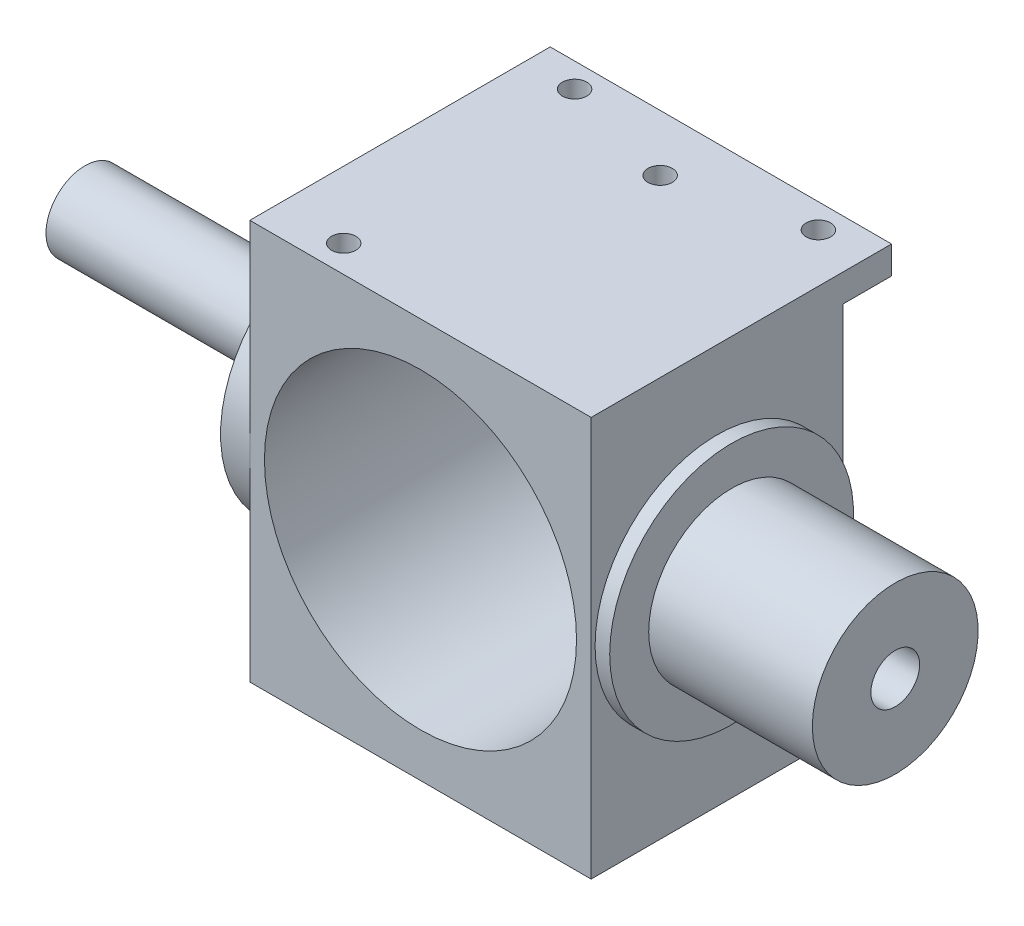
ISO-10303-21;
HEADER;
FILE_DESCRIPTION(('STEP AP214'),'2;1');
FILE_NAME('part.step','',(''),(''),'','','');
FILE_SCHEMA(('AUTOMOTIVE_DESIGN { 1 0 10303 214 1 1 1 1 }'));
ENDSEC;
DATA;
#1=APPLICATION_CONTEXT('core data for automotive mechanical design processes');
#2=APPLICATION_PROTOCOL_DEFINITION('international standard','automotive_design',2000,#1);
#3=PRODUCT_CONTEXT('',#1,'mechanical');
#4=PRODUCT('Part','Part','',(#3));
#5=PRODUCT_RELATED_PRODUCT_CATEGORY('part','',(#4));
#6=PRODUCT_DEFINITION_FORMATION('','',#4);
#7=PRODUCT_DEFINITION_CONTEXT('part definition',#1,'design');
#8=PRODUCT_DEFINITION('design','',#6,#7);
#9=PRODUCT_DEFINITION_SHAPE('','',#8);
#10=(LENGTH_UNIT() NAMED_UNIT(*) SI_UNIT(.MILLI.,.METRE.));
#11=(NAMED_UNIT(*) PLANE_ANGLE_UNIT() SI_UNIT($,.RADIAN.));
#12=(NAMED_UNIT(*) SI_UNIT($,.STERADIAN.) SOLID_ANGLE_UNIT());
#13=UNCERTAINTY_MEASURE_WITH_UNIT(LENGTH_MEASURE(1.E-05),#10,'distance_accuracy_value','');
#14=(GEOMETRIC_REPRESENTATION_CONTEXT(3) GLOBAL_UNCERTAINTY_ASSIGNED_CONTEXT((#13)) GLOBAL_UNIT_ASSIGNED_CONTEXT((#10,
#11,#12)) REPRESENTATION_CONTEXT('',''));
#15=CARTESIAN_POINT('',(0.,0.,0.));
#16=DIRECTION('',(0.,0.,1.));
#17=DIRECTION('',(1.,0.,0.));
#18=AXIS2_PLACEMENT_3D('',#15,#16,#17);
#19=CARTESIAN_POINT('',(53.5807438589496,27.618402196632,37.7129267767126));
#20=DIRECTION('',(-1.,0.,0.));
#21=DIRECTION('',(0.,0.,1.));
#22=AXIS2_PLACEMENT_3D('',#19,#20,#21);
#23=CYLINDRICAL_SURFACE('',#22,8.5);
#24=CARTESIAN_POINT('',(53.5807438589496,27.618402196632,37.7129267767126));
#25=DIRECTION('',(-1.,0.,0.));
#26=DIRECTION('',(0.,0.,1.));
#27=AXIS2_PLACEMENT_3D('',#24,#25,#26);
#28=CIRCLE('',#27,8.5);
#29=CARTESIAN_POINT('',(53.5807438589496,27.618402196632,46.2129267767126));
#30=VERTEX_POINT('',#29);
#31=EDGE_CURVE('E11',#30,#30,#28,.T.);
#32=ORIENTED_EDGE('',*,*,#31,.T.);
#33=EDGE_LOOP('',(#32));
#34=FACE_BOUND('',#33,.T.);
#35=CARTESIAN_POINT('',(36.7995438589496,27.618402196632,37.7129267767126));
#36=DIRECTION('',(-1.,0.,0.));
#37=DIRECTION('',(0.,0.,1.));
#38=AXIS2_PLACEMENT_3D('',#35,#36,#37);
#39=CIRCLE('',#38,8.5);
#40=CARTESIAN_POINT('',(36.7995438589496,27.618402196632,46.2129267767126));
#41=VERTEX_POINT('',#40);
#42=EDGE_CURVE('E57',#41,#41,#39,.T.);
#43=ORIENTED_EDGE('',*,*,#42,.F.);
#44=EDGE_LOOP('',(#43));
#45=FACE_BOUND('',#44,.T.);
#46=ADVANCED_FACE('F43',(#34,#45),#23,.T.);
#47=CARTESIAN_POINT('',(53.5807438589496,36.118402196632,37.7129267767126));
#48=DIRECTION('',(1.,0.,0.));
#49=DIRECTION('',(0.,0.,-1.));
#50=AXIS2_PLACEMENT_3D('',#47,#48,#49);
#51=PLANE('',#50);
#52=CARTESIAN_POINT('',(53.5807438589496,27.618402196632,37.7129267767126));
#53=DIRECTION('',(1.,0.,0.));
#54=DIRECTION('',(0.,0.,-1.));
#55=AXIS2_PLACEMENT_3D('',#52,#53,#54);
#56=CIRCLE('',#55,2.49999999999998);
#57=CARTESIAN_POINT('',(53.5807438589496,27.618402196632,35.2129267767126));
#58=VERTEX_POINT('',#57);
#59=EDGE_CURVE('E65',#58,#58,#56,.T.);
#60=ORIENTED_EDGE('',*,*,#59,.F.);
#61=EDGE_LOOP('',(#60));
#62=FACE_BOUND('',#61,.T.);
#63=ORIENTED_EDGE('',*,*,#31,.F.);
#64=EDGE_LOOP('',(#63));
#65=FACE_BOUND('',#64,.T.);
#66=ADVANCED_FACE('F72',(#62,#65),#51,.T.);
#67=CARTESIAN_POINT('',(35.2995438589496,27.618402196632,37.7129267767126));
#68=DIRECTION('',(-1.,0.,0.));
#69=DIRECTION('',(0.,0.,1.));
#70=AXIS2_PLACEMENT_3D('',#67,#68,#69);
#71=PLANE('',#70);
#72=CARTESIAN_POINT('',(35.2995438589496,27.618402196632,37.7129267767126));
#73=DIRECTION('',(-1.,0.,0.));
#74=DIRECTION('',(0.,0.,1.));
#75=AXIS2_PLACEMENT_3D('',#72,#73,#74);
#76=CIRCLE('',#75,2.49999999999998);
#77=CARTESIAN_POINT('',(35.2995438589496,27.618402196632,40.2129267767126));
#78=VERTEX_POINT('',#77);
#79=EDGE_CURVE('E62',#78,#78,#76,.T.);
#80=ORIENTED_EDGE('',*,*,#79,.F.);
#81=EDGE_LOOP('',(#80));
#82=FACE_BOUND('',#81,.T.);
#83=CARTESIAN_POINT('',(35.2995438589496,27.618402196632,37.7129267767126));
#84=DIRECTION('',(-1.,0.,0.));
#85=DIRECTION('',(0.,0.,1.));
#86=AXIS2_PLACEMENT_3D('',#83,#84,#85);
#87=CIRCLE('',#86,12.5);
#88=CARTESIAN_POINT('',(35.2995438589496,27.618402196632,50.2129267767126));
#89=VERTEX_POINT('',#88);
#90=EDGE_CURVE('E49',#89,#89,#87,.T.);
#91=ORIENTED_EDGE('',*,*,#90,.T.);
#92=EDGE_LOOP('',(#91));
#93=FACE_BOUND('',#92,.T.);
#94=ADVANCED_FACE('F75',(#82,#93),#71,.T.);
#95=CARTESIAN_POINT('',(53.5807438589496,27.618402196632,37.7129267767126));
#96=DIRECTION('',(-1.,0.,0.));
#97=DIRECTION('',(0.,0.,1.));
#98=AXIS2_PLACEMENT_3D('',#95,#96,#97);
#99=CYLINDRICAL_SURFACE('',#98,12.5);
#100=CARTESIAN_POINT('',(36.7995438589496,27.618402196632,37.7129267767126));
#101=DIRECTION('',(-1.,0.,0.));
#102=DIRECTION('',(0.,0.,1.));
#103=AXIS2_PLACEMENT_3D('',#100,#101,#102);
#104=CIRCLE('',#103,12.5);
#105=CARTESIAN_POINT('',(36.7995438589496,27.618402196632,50.2129267767126));
#106=VERTEX_POINT('',#105);
#107=EDGE_CURVE('E53',#106,#106,#104,.T.);
#108=ORIENTED_EDGE('',*,*,#107,.T.);
#109=EDGE_LOOP('',(#108));
#110=FACE_BOUND('',#109,.T.);
#111=ORIENTED_EDGE('',*,*,#90,.F.);
#112=EDGE_LOOP('',(#111));
#113=FACE_BOUND('',#112,.T.);
#114=ADVANCED_FACE('F80',(#110,#113),#99,.T.);
#115=CARTESIAN_POINT('',(36.7995438589496,40.118402196632,37.7129267767126));
#116=DIRECTION('',(1.,0.,0.));
#117=DIRECTION('',(0.,0.,-1.));
#118=AXIS2_PLACEMENT_3D('',#115,#116,#117);
#119=PLANE('',#118);
#120=ORIENTED_EDGE('',*,*,#42,.T.);
#121=EDGE_LOOP('',(#120));
#122=FACE_BOUND('',#121,.T.);
#123=ORIENTED_EDGE('',*,*,#107,.F.);
#124=EDGE_LOOP('',(#123));
#125=FACE_BOUND('',#124,.T.);
#126=ADVANCED_FACE('F86',(#122,#125),#119,.T.);
#127=CARTESIAN_POINT('',(53.5807438589496,27.618402196632,37.7129267767126));
#128=DIRECTION('',(1.,0.,0.));
#129=DIRECTION('',(0.,0.,-1.));
#130=AXIS2_PLACEMENT_3D('',#127,#128,#129);
#131=CYLINDRICAL_SURFACE('',#130,2.49999999999998);
#132=ORIENTED_EDGE('',*,*,#59,.T.);
#133=EDGE_LOOP('',(#132));
#134=FACE_BOUND('',#133,.T.);
#135=ORIENTED_EDGE('',*,*,#79,.T.);
#136=EDGE_LOOP('',(#135));
#137=FACE_BOUND('',#136,.T.);
#138=ADVANCED_FACE('F69',(#134,#137),#131,.F.);
#139=CLOSED_SHELL('',(#46,#66,#94,#114,#126,#138));
#140=MANIFOLD_SOLID_BREP('B2',#139);
#141=CARTESIAN_POINT('',(0.,0.,19.8129267767126));
#142=DIRECTION('',(0.,0.,-1.));
#143=DIRECTION('',(-1.,0.,0.));
#144=AXIS2_PLACEMENT_3D('',#141,#142,#143);
#145=PLANE('',#144);
#146=DIRECTION('',(-1.,0.,0.));
#147=VECTOR('',#146,1.);
#148=CARTESIAN_POINT('',(0.,10.118402196632,19.8129267767126));
#149=LINE('',#148,#147);
#150=CARTESIAN_POINT('',(35.2995438589496,10.118402196632,19.8129267767126));
#151=VERTEX_POINT('',#150);
#152=CARTESIAN_POINT('',(0.299543858949605,10.118402196632,19.8129267767126));
#153=VERTEX_POINT('',#152);
#154=EDGE_CURVE('E154',#151,#153,#149,.T.);
#155=ORIENTED_EDGE('',*,*,#154,.F.);
#156=DIRECTION('',(0.,-1.,0.));
#157=VECTOR('',#156,1.);
#158=CARTESIAN_POINT('',(35.2995438589496,48.118402196632,19.8129267767126));
#159=LINE('',#158,#157);
#160=CARTESIAN_POINT('',(35.2995438589496,7.11840219663202,19.8129267767126));
#161=VERTEX_POINT('',#160);
#162=EDGE_CURVE('E281',#151,#161,#159,.T.);
#163=ORIENTED_EDGE('',*,*,#162,.T.);
#164=DIRECTION('',(-1.,0.,0.));
#165=VECTOR('',#164,1.);
#166=CARTESIAN_POINT('',(35.2995438589496,7.11840219663202,19.8129267767126));
#167=LINE('',#166,#165);
#168=CARTESIAN_POINT('',(0.299543858949612,7.11840219663202,19.8129267767126));
#169=VERTEX_POINT('',#168);
#170=EDGE_CURVE('E265',#161,#169,#167,.T.);
#171=ORIENTED_EDGE('',*,*,#170,.T.);
#172=DIRECTION('',(0.,1.,0.));
#173=VECTOR('',#172,1.);
#174=CARTESIAN_POINT('',(0.299543858949612,7.11840219663202,19.8129267767126));
#175=LINE('',#174,#173);
#176=EDGE_CURVE('E275',#169,#153,#175,.T.);
#177=ORIENTED_EDGE('',*,*,#176,.T.);
#178=EDGE_LOOP('',(#155,#163,#171,#177));
#179=FACE_BOUND('',#178,.T.);
#180=ADVANCED_FACE('F141',(#179),#145,.T.);
#181=CARTESIAN_POINT('',(0.299543858949612,7.11840219663202,50.6129267767126));
#182=DIRECTION('',(-1.,0.,0.));
#183=DIRECTION('',(0.,-1.,0.));
#184=AXIS2_PLACEMENT_3D('',#181,#182,#183);
#185=PLANE('',#184);
#186=DIRECTION('',(0.,0.,1.));
#187=VECTOR('',#186,1.);
#188=CARTESIAN_POINT('',(0.299543858949612,10.118402196632,50.6129267767126));
#189=LINE('',#188,#187);
#190=CARTESIAN_POINT('',(0.299543858949609,10.118402196632,24.8129267767126));
#191=VERTEX_POINT('',#190);
#192=EDGE_CURVE('E256',#153,#191,#189,.T.);
#193=ORIENTED_EDGE('',*,*,#192,.F.);
#194=ORIENTED_EDGE('',*,*,#176,.F.);
#195=DIRECTION('',(0.,0.,-1.));
#196=VECTOR('',#195,1.);
#197=CARTESIAN_POINT('',(0.299543858949612,7.11840219663202,50.6129267767126));
#198=LINE('',#197,#196);
#199=CARTESIAN_POINT('',(0.299543858949612,7.11840219663202,50.6129267767126));
#200=VERTEX_POINT('',#199);
#201=EDGE_CURVE('E287',#200,#169,#198,.T.);
#202=ORIENTED_EDGE('',*,*,#201,.F.);
#203=DIRECTION('',(0.,1.,0.));
#204=VECTOR('',#203,1.);
#205=CARTESIAN_POINT('',(0.299543858949612,7.11840219663202,50.6129267767126));
#206=LINE('',#205,#204);
#207=CARTESIAN_POINT('',(0.299543858949605,48.118402196632,50.6129267767126));
#208=VERTEX_POINT('',#207);
#209=EDGE_CURVE('E261',#200,#208,#206,.T.);
#210=ORIENTED_EDGE('',*,*,#209,.T.);
#211=DIRECTION('',(0.,0.,-1.));
#212=VECTOR('',#211,1.);
#213=CARTESIAN_POINT('',(0.299543858949605,48.118402196632,50.6129267767126));
#214=LINE('',#213,#212);
#215=CARTESIAN_POINT('',(0.299543858949605,48.118402196632,19.8129267767126));
#216=VERTEX_POINT('',#215);
#217=EDGE_CURVE('E274',#208,#216,#214,.T.);
#218=ORIENTED_EDGE('',*,*,#217,.T.);
#219=CARTESIAN_POINT('',(0.299543858949606,45.272002196632,19.8129267767126));
#220=VERTEX_POINT('',#219);
#221=EDGE_CURVE('E260',#220,#216,#175,.T.);
#222=ORIENTED_EDGE('',*,*,#221,.F.);
#223=DIRECTION('',(0.,0.,-1.));
#224=VECTOR('',#223,1.);
#225=CARTESIAN_POINT('',(0.299543858949606,45.272002196632,50.6129267767126));
#226=LINE('',#225,#224);
#227=CARTESIAN_POINT('',(0.299543858949605,45.272002196632,24.8129267767126));
#228=VERTEX_POINT('',#227);
#229=EDGE_CURVE('E168',#228,#220,#226,.T.);
#230=ORIENTED_EDGE('',*,*,#229,.F.);
#231=DIRECTION('',(0.,1.,0.));
#232=VECTOR('',#231,1.);
#233=CARTESIAN_POINT('',(0.299543858949612,7.11840219663202,24.8129267767126));
#234=LINE('',#233,#232);
#235=EDGE_CURVE('E258',#191,#228,#234,.T.);
#236=ORIENTED_EDGE('',*,*,#235,.F.);
#237=EDGE_LOOP('',(#193,#194,#202,#210,#218,#222,#230,#236));
#238=FACE_BOUND('',#237,.T.);
#239=ADVANCED_FACE('F347',(#238),#185,.T.);
#240=CARTESIAN_POINT('',(35.2995438589496,7.11840219663202,50.6129267767126));
#241=DIRECTION('',(0.,-1.,0.));
#242=DIRECTION('',(0.,0.,-1.));
#243=AXIS2_PLACEMENT_3D('',#240,#241,#242);
#244=PLANE('',#243);
#245=CARTESIAN_POINT('',(5.29954385894961,7.11840219663201,22.3129267767126));
#246=DIRECTION('',(0.,1.,0.));
#247=DIRECTION('',(0.,0.,1.));
#248=AXIS2_PLACEMENT_3D('',#245,#246,#247);
#249=CIRCLE('',#248,1.24999999999997);
#250=CARTESIAN_POINT('',(5.29954385894961,7.11840219663201,23.5629267767126));
#251=VERTEX_POINT('',#250);
#252=EDGE_CURVE('E411',#251,#251,#249,.T.);
#253=ORIENTED_EDGE('',*,*,#252,.T.);
#254=EDGE_LOOP('',(#253));
#255=FACE_BOUND('',#254,.T.);
#256=CARTESIAN_POINT('',(30.2995438589496,7.11840219663202,22.3129267767126));
#257=DIRECTION('',(0.,1.,0.));
#258=DIRECTION('',(0.,0.,1.));
#259=AXIS2_PLACEMENT_3D('',#256,#257,#258);
#260=CIRCLE('',#259,1.24999999999997);
#261=CARTESIAN_POINT('',(30.2995438589496,7.11840219663201,23.5629267767126));
#262=VERTEX_POINT('',#261);
#263=EDGE_CURVE('E405',#262,#262,#260,.T.);
#264=ORIENTED_EDGE('',*,*,#263,.T.);
#265=EDGE_LOOP('',(#264));
#266=FACE_BOUND('',#265,.T.);
#267=ORIENTED_EDGE('',*,*,#170,.F.);
#268=DIRECTION('',(0.,0.,-1.));
#269=VECTOR('',#268,1.);
#270=CARTESIAN_POINT('',(35.2995438589496,7.11840219663202,50.6129267767126));
#271=LINE('',#270,#269);
#272=CARTESIAN_POINT('',(35.2995438589496,7.11840219663202,50.6129267767126));
#273=VERTEX_POINT('',#272);
#274=EDGE_CURVE('E290',#273,#161,#271,.T.);
#275=ORIENTED_EDGE('',*,*,#274,.F.);
#276=DIRECTION('',(-1.,0.,0.));
#277=VECTOR('',#276,1.);
#278=CARTESIAN_POINT('',(35.2995438589496,7.11840219663202,50.6129267767126));
#279=LINE('',#278,#277);
#280=EDGE_CURVE('E271',#273,#200,#279,.T.);
#281=ORIENTED_EDGE('',*,*,#280,.T.);
#282=ORIENTED_EDGE('',*,*,#201,.T.);
#283=EDGE_LOOP('',(#267,#275,#281,#282));
#284=FACE_BOUND('',#283,.T.);
#285=ADVANCED_FACE('F354',(#255,#266,#284),#244,.T.);
#286=CARTESIAN_POINT('',(35.2995438589496,48.118402196632,50.6129267767126));
#287=DIRECTION('',(1.,0.,0.));
#288=DIRECTION('',(0.,1.,0.));
#289=AXIS2_PLACEMENT_3D('',#286,#287,#288);
#290=PLANE('',#289);
#291=CARTESIAN_POINT('',(35.2995438589496,27.618402196632,37.7129267767126));
#292=DIRECTION('',(1.,0.,0.));
#293=DIRECTION('',(0.,1.,0.));
#294=AXIS2_PLACEMENT_3D('',#291,#292,#293);
#295=CIRCLE('',#294,2.49999999999998);
#296=CARTESIAN_POINT('',(35.2995438589496,30.118402196632,37.7129267767126));
#297=VERTEX_POINT('',#296);
#298=EDGE_CURVE('E242',#297,#297,#295,.T.);
#299=ORIENTED_EDGE('',*,*,#298,.F.);
#300=EDGE_LOOP('',(#299));
#301=FACE_BOUND('',#300,.T.);
#302=DIRECTION('',(0.,0.,-1.));
#303=VECTOR('',#302,1.);
#304=CARTESIAN_POINT('',(35.2995438589496,10.118402196632,24.8129267767126));
#305=LINE('',#304,#303);
#306=CARTESIAN_POINT('',(35.2995438589496,10.118402196632,24.8129267767126));
#307=VERTEX_POINT('',#306);
#308=EDGE_CURVE('E236',#307,#151,#305,.T.);
#309=ORIENTED_EDGE('',*,*,#308,.F.);
#310=DIRECTION('',(0.,-1.,0.));
#311=VECTOR('',#310,1.);
#312=CARTESIAN_POINT('',(35.2995438589496,45.272002196632,24.8129267767126));
#313=LINE('',#312,#311);
#314=CARTESIAN_POINT('',(35.2995438589496,45.272002196632,24.8129267767126));
#315=VERTEX_POINT('',#314);
#316=EDGE_CURVE('E248',#315,#307,#313,.T.);
#317=ORIENTED_EDGE('',*,*,#316,.F.);
#318=DIRECTION('',(0.,0.,1.));
#319=VECTOR('',#318,1.);
#320=CARTESIAN_POINT('',(35.2995438589496,45.272002196632,19.8129267767126));
#321=LINE('',#320,#319);
#322=CARTESIAN_POINT('',(35.2995438589496,45.272002196632,19.8129267767126));
#323=VERTEX_POINT('',#322);
#324=EDGE_CURVE('E239',#323,#315,#321,.T.);
#325=ORIENTED_EDGE('',*,*,#324,.F.);
#326=CARTESIAN_POINT('',(35.2995438589496,48.118402196632,19.8129267767126));
#327=VERTEX_POINT('',#326);
#328=EDGE_CURVE('E282',#327,#323,#159,.T.);
#329=ORIENTED_EDGE('',*,*,#328,.F.);
#330=DIRECTION('',(0.,0.,-1.));
#331=VECTOR('',#330,1.);
#332=CARTESIAN_POINT('',(35.2995438589496,48.118402196632,50.6129267767126));
#333=LINE('',#332,#331);
#334=CARTESIAN_POINT('',(35.2995438589496,48.118402196632,50.6129267767126));
#335=VERTEX_POINT('',#334);
#336=EDGE_CURVE('E293',#335,#327,#333,.T.);
#337=ORIENTED_EDGE('',*,*,#336,.F.);
#338=DIRECTION('',(0.,-1.,0.));
#339=VECTOR('',#338,1.);
#340=CARTESIAN_POINT('',(35.2995438589496,48.118402196632,50.6129267767126));
#341=LINE('',#340,#339);
#342=EDGE_CURVE('E268',#335,#273,#341,.T.);
#343=ORIENTED_EDGE('',*,*,#342,.T.);
#344=ORIENTED_EDGE('',*,*,#274,.T.);
#345=ORIENTED_EDGE('',*,*,#162,.F.);
#346=EDGE_LOOP('',(#309,#317,#325,#329,#337,#343,#344,#345));
#347=FACE_BOUND('',#346,.T.);
#348=ADVANCED_FACE('F383',(#301,#347),#290,.T.);
#349=CARTESIAN_POINT('',(0.299543858949605,48.118402196632,50.6129267767126));
#350=DIRECTION('',(0.,1.,0.));
#351=DIRECTION('',(0.,0.,1.));
#352=AXIS2_PLACEMENT_3D('',#349,#350,#351);
#353=PLANE('',#352);
#354=CARTESIAN_POINT('',(5.29954385894961,48.118402196632,22.3129267767126));
#355=DIRECTION('',(0.,-1.,0.));
#356=DIRECTION('',(0.,0.,-1.));
#357=AXIS2_PLACEMENT_3D('',#354,#355,#356);
#358=CIRCLE('',#357,1.24999999999998);
#359=CARTESIAN_POINT('',(5.29954385894961,48.118402196632,21.0629267767126));
#360=VERTEX_POINT('',#359);
#361=EDGE_CURVE('E399',#360,#360,#358,.T.);
#362=ORIENTED_EDGE('',*,*,#361,.T.);
#363=EDGE_LOOP('',(#362));
#364=FACE_BOUND('',#363,.T.);
#365=CARTESIAN_POINT('',(30.2995438589496,48.118402196632,22.3129267767126));
#366=DIRECTION('',(0.,-1.,0.));
#367=DIRECTION('',(0.,0.,-1.));
#368=AXIS2_PLACEMENT_3D('',#365,#366,#367);
#369=CIRCLE('',#368,1.24999999999998);
#370=CARTESIAN_POINT('',(30.2995438589496,48.118402196632,21.0629267767126));
#371=VERTEX_POINT('',#370);
#372=EDGE_CURVE('E393',#371,#371,#369,.T.);
#373=ORIENTED_EDGE('',*,*,#372,.T.);
#374=EDGE_LOOP('',(#373));
#375=FACE_BOUND('',#374,.T.);
#376=CARTESIAN_POINT('',(17.3495438589496,48.118402196632,25.5879267767126));
#377=DIRECTION('',(0.,1.,0.));
#378=DIRECTION('',(0.,0.,1.));
#379=AXIS2_PLACEMENT_3D('',#376,#377,#378);
#380=CIRCLE('',#379,1.24999999999999);
#381=CARTESIAN_POINT('',(17.3495438589496,48.118402196632,26.8379267767126));
#382=VERTEX_POINT('',#381);
#383=EDGE_CURVE('E233',#382,#382,#380,.T.);
#384=ORIENTED_EDGE('',*,*,#383,.F.);
#385=EDGE_LOOP('',(#384));
#386=FACE_BOUND('',#385,.T.);
#387=CARTESIAN_POINT('',(7.1495438589496,48.118402196632,47.8379267767126));
#388=DIRECTION('',(0.,1.,0.));
#389=DIRECTION('',(0.,0.,1.));
#390=AXIS2_PLACEMENT_3D('',#387,#388,#389);
#391=CIRCLE('',#390,1.24999999999998);
#392=CARTESIAN_POINT('',(7.1495438589496,48.118402196632,49.0879267767126));
#393=VERTEX_POINT('',#392);
#394=EDGE_CURVE('E307',#393,#393,#391,.T.);
#395=ORIENTED_EDGE('',*,*,#394,.F.);
#396=EDGE_LOOP('',(#395));
#397=FACE_BOUND('',#396,.T.);
#398=DIRECTION('',(1.,0.,0.));
#399=VECTOR('',#398,1.);
#400=CARTESIAN_POINT('',(0.299543858949605,48.118402196632,19.8129267767126));
#401=LINE('',#400,#399);
#402=EDGE_CURVE('E278',#216,#327,#401,.T.);
#403=ORIENTED_EDGE('',*,*,#402,.F.);
#404=ORIENTED_EDGE('',*,*,#217,.F.);
#405=DIRECTION('',(1.,0.,0.));
#406=VECTOR('',#405,1.);
#407=CARTESIAN_POINT('',(0.299543858949605,48.118402196632,50.6129267767126));
#408=LINE('',#407,#406);
#409=EDGE_CURVE('E264',#208,#335,#408,.T.);
#410=ORIENTED_EDGE('',*,*,#409,.T.);
#411=ORIENTED_EDGE('',*,*,#336,.T.);
#412=EDGE_LOOP('',(#403,#404,#410,#411));
#413=FACE_BOUND('',#412,.T.);
#414=ADVANCED_FACE('F369',(#364,#375,#386,#397,#413),#353,.T.);
#415=CARTESIAN_POINT('',(0.,0.,50.6129267767126));
#416=DIRECTION('',(0.,0.,-1.));
#417=DIRECTION('',(-1.,0.,0.));
#418=AXIS2_PLACEMENT_3D('',#415,#416,#417);
#419=PLANE('',#418);
#420=CARTESIAN_POINT('',(17.7995438589496,27.618402196632,50.6129267767126));
#421=DIRECTION('',(0.,0.,1.));
#422=DIRECTION('',(1.,0.,0.));
#423=AXIS2_PLACEMENT_3D('',#420,#421,#422);
#424=CIRCLE('',#423,16.);
#425=CARTESIAN_POINT('',(33.7995438589496,27.618402196632,50.6129267767126));
#426=VERTEX_POINT('',#425);
#427=EDGE_CURVE('E237',#426,#426,#424,.T.);
#428=ORIENTED_EDGE('',*,*,#427,.F.);
#429=EDGE_LOOP('',(#428));
#430=FACE_BOUND('',#429,.T.);
#431=ORIENTED_EDGE('',*,*,#209,.F.);
#432=ORIENTED_EDGE('',*,*,#280,.F.);
#433=ORIENTED_EDGE('',*,*,#342,.F.);
#434=ORIENTED_EDGE('',*,*,#409,.F.);
#435=EDGE_LOOP('',(#431,#432,#433,#434));
#436=FACE_BOUND('',#435,.T.);
#437=ADVANCED_FACE('F361',(#430,#436),#419,.F.);
#438=DIRECTION('',(1.,0.,0.));
#439=VECTOR('',#438,1.);
#440=CARTESIAN_POINT('',(0.,45.272002196632,19.8129267767126));
#441=LINE('',#440,#439);
#442=EDGE_CURVE('E289',#220,#323,#441,.T.);
#443=ORIENTED_EDGE('',*,*,#442,.F.);
#444=ORIENTED_EDGE('',*,*,#221,.T.);
#445=ORIENTED_EDGE('',*,*,#402,.T.);
#446=ORIENTED_EDGE('',*,*,#328,.T.);
#447=EDGE_LOOP('',(#443,#444,#445,#446));
#448=FACE_BOUND('',#447,.T.);
#449=ADVANCED_FACE('F350',(#448),#145,.T.);
#450=CARTESIAN_POINT('',(-29.5004561410504,10.118402196632,24.8129267767126));
#451=DIRECTION('',(0.,-1.,0.));
#452=DIRECTION('',(0.,0.,-1.));
#453=AXIS2_PLACEMENT_3D('',#450,#451,#452);
#454=PLANE('',#453);
#455=CARTESIAN_POINT('',(5.29954385894961,10.118402196632,22.3129267767126));
#456=DIRECTION('',(0.,1.,0.));
#457=DIRECTION('',(0.,0.,1.));
#458=AXIS2_PLACEMENT_3D('',#455,#456,#457);
#459=CIRCLE('',#458,1.24999999999997);
#460=CARTESIAN_POINT('',(5.29954385894961,10.118402196632,23.5629267767126));
#461=VERTEX_POINT('',#460);
#462=EDGE_CURVE('E414',#461,#461,#459,.T.);
#463=ORIENTED_EDGE('',*,*,#462,.F.);
#464=EDGE_LOOP('',(#463));
#465=FACE_BOUND('',#464,.T.);
#466=CARTESIAN_POINT('',(30.2995438589496,10.118402196632,22.3129267767126));
#467=DIRECTION('',(0.,1.,0.));
#468=DIRECTION('',(0.,0.,1.));
#469=AXIS2_PLACEMENT_3D('',#466,#467,#468);
#470=CIRCLE('',#469,1.24999999999997);
#471=CARTESIAN_POINT('',(30.2995438589496,10.118402196632,23.5629267767126));
#472=VERTEX_POINT('',#471);
#473=EDGE_CURVE('E408',#472,#472,#470,.T.);
#474=ORIENTED_EDGE('',*,*,#473,.F.);
#475=EDGE_LOOP('',(#474));
#476=FACE_BOUND('',#475,.T.);
#477=ORIENTED_EDGE('',*,*,#192,.T.);
#478=DIRECTION('',(1.,0.,0.));
#479=VECTOR('',#478,1.);
#480=CARTESIAN_POINT('',(-29.5004561410504,10.118402196632,24.8129267767126));
#481=LINE('',#480,#479);
#482=EDGE_CURVE('E252',#191,#307,#481,.T.);
#483=ORIENTED_EDGE('',*,*,#482,.T.);
#484=ORIENTED_EDGE('',*,*,#308,.T.);
#485=ORIENTED_EDGE('',*,*,#154,.T.);
#486=EDGE_LOOP('',(#477,#483,#484,#485));
#487=FACE_BOUND('',#486,.T.);
#488=ADVANCED_FACE('F360',(#465,#476,#487),#454,.F.);
#489=CARTESIAN_POINT('',(-29.5004561410504,45.272002196632,24.8129267767126));
#490=DIRECTION('',(0.,0.,1.));
#491=DIRECTION('',(1.,0.,0.));
#492=AXIS2_PLACEMENT_3D('',#489,#490,#491);
#493=PLANE('',#492);
#494=CARTESIAN_POINT('',(17.7995438589496,27.618402196632,24.8129267767126));
#495=DIRECTION('',(0.,0.,1.));
#496=DIRECTION('',(1.,0.,0.));
#497=AXIS2_PLACEMENT_3D('',#494,#495,#496);
#498=CIRCLE('',#497,16.);
#499=CARTESIAN_POINT('',(16.3687915966529,43.554303425114,24.8129267767126));
#500=VERTEX_POINT('',#499);
#501=CARTESIAN_POINT('',(18.3302961212462,43.6095967122418,24.8129267767126));
#502=VERTEX_POINT('',#501);
#503=EDGE_CURVE('E230',#500,#502,#498,.T.);
#504=ORIENTED_EDGE('',*,*,#503,.T.);
#505=DIRECTION('',(0.,1.,0.));
#506=VECTOR('',#505,1.);
#507=CARTESIAN_POINT('',(18.3302961212462,48.118402196632,24.8129267767126));
#508=LINE('',#507,#506);
#509=CARTESIAN_POINT('',(18.3302961212462,45.272002196632,24.8129267767126));
#510=VERTEX_POINT('',#509);
#511=EDGE_CURVE('E161',#502,#510,#508,.T.);
#512=ORIENTED_EDGE('',*,*,#511,.T.);
#513=DIRECTION('',(1.,0.,0.));
#514=VECTOR('',#513,1.);
#515=CARTESIAN_POINT('',(-29.5004561410504,45.272002196632,24.8129267767126));
#516=LINE('',#515,#514);
#517=EDGE_CURVE('E251',#510,#315,#516,.T.);
#518=ORIENTED_EDGE('',*,*,#517,.T.);
#519=ORIENTED_EDGE('',*,*,#316,.T.);
#520=ORIENTED_EDGE('',*,*,#482,.F.);
#521=ORIENTED_EDGE('',*,*,#235,.T.);
#522=CARTESIAN_POINT('',(16.3687915966529,45.272002196632,24.8129267767126));
#523=VERTEX_POINT('',#522);
#524=EDGE_CURVE('E231',#228,#523,#516,.T.);
#525=ORIENTED_EDGE('',*,*,#524,.T.);
#526=DIRECTION('',(0.,1.,0.));
#527=VECTOR('',#526,1.);
#528=CARTESIAN_POINT('',(16.3687915966529,48.118402196632,24.8129267767126));
#529=LINE('',#528,#527);
#530=EDGE_CURVE('E222',#523,#500,#529,.F.);
#531=ORIENTED_EDGE('',*,*,#530,.T.);
#532=EDGE_LOOP('',(#504,#512,#518,#519,#520,#521,#525,#531));
#533=FACE_BOUND('',#532,.T.);
#534=ADVANCED_FACE('F229',(#533),#493,.F.);
#535=CARTESIAN_POINT('',(-29.5004561410504,45.272002196632,19.8129267767126));
#536=DIRECTION('',(0.,1.,0.));
#537=DIRECTION('',(-1.,0.,0.));
#538=AXIS2_PLACEMENT_3D('',#535,#536,#537);
#539=PLANE('',#538);
#540=CARTESIAN_POINT('',(5.29954385894961,45.272002196632,22.3129267767126));
#541=DIRECTION('',(0.,-1.,0.));
#542=DIRECTION('',(0.,0.,-1.));
#543=AXIS2_PLACEMENT_3D('',#540,#541,#542);
#544=CIRCLE('',#543,1.24999999999998);
#545=CARTESIAN_POINT('',(5.29954385894961,45.272002196632,21.0629267767126));
#546=VERTEX_POINT('',#545);
#547=EDGE_CURVE('E402',#546,#546,#544,.T.);
#548=ORIENTED_EDGE('',*,*,#547,.F.);
#549=EDGE_LOOP('',(#548));
#550=FACE_BOUND('',#549,.T.);
#551=CARTESIAN_POINT('',(30.2995438589496,45.272002196632,22.3129267767126));
#552=DIRECTION('',(0.,-1.,0.));
#553=DIRECTION('',(0.,0.,-1.));
#554=AXIS2_PLACEMENT_3D('',#551,#552,#553);
#555=CIRCLE('',#554,1.24999999999998);
#556=CARTESIAN_POINT('',(30.2995438589496,45.272002196632,21.0629267767126));
#557=VERTEX_POINT('',#556);
#558=EDGE_CURVE('E396',#557,#557,#555,.T.);
#559=ORIENTED_EDGE('',*,*,#558,.F.);
#560=EDGE_LOOP('',(#559));
#561=FACE_BOUND('',#560,.T.);
#562=ORIENTED_EDGE('',*,*,#517,.F.);
#563=CARTESIAN_POINT('',(17.3495438589496,45.272002196632,25.5879267767126));
#564=DIRECTION('',(0.,1.,0.));
#565=DIRECTION('',(-1.,0.,0.));
#566=AXIS2_PLACEMENT_3D('',#563,#564,#565);
#567=CIRCLE('',#566,1.24999999999999);
#568=EDGE_CURVE('E232',#510,#523,#567,.T.);
#569=ORIENTED_EDGE('',*,*,#568,.T.);
#570=ORIENTED_EDGE('',*,*,#524,.F.);
#571=ORIENTED_EDGE('',*,*,#229,.T.);
#572=ORIENTED_EDGE('',*,*,#442,.T.);
#573=ORIENTED_EDGE('',*,*,#324,.T.);
#574=EDGE_LOOP('',(#562,#569,#570,#571,#572,#573));
#575=FACE_BOUND('',#574,.T.);
#576=ADVANCED_FACE('F386',(#550,#561,#575),#539,.F.);
#577=CARTESIAN_POINT('',(17.7995438589496,27.618402196632,50.6129267767126));
#578=DIRECTION('',(0.,0.,1.));
#579=DIRECTION('',(1.,0.,0.));
#580=AXIS2_PLACEMENT_3D('',#577,#578,#579);
#581=CYLINDRICAL_SURFACE('',#580,16.);
#582=CARTESIAN_POINT('',(7.1495438589496,39.5589842594965,49.0879267767126));
#583=CARTESIAN_POINT('',(7.22841025100024,39.6293251701633,49.0879275253317));
#584=CARTESIAN_POINT('',(7.30801002333441,39.698910166747,49.08047969827));
#585=CARTESIAN_POINT('',(7.46693001150936,39.8351136817398,49.0496689824288));
#586=CARTESIAN_POINT('',(7.54624984198888,39.9017289803233,49.0262892464861));
#587=CARTESIAN_POINT('',(7.68975799179025,40.0199943000132,48.9673982728999));
#588=CARTESIAN_POINT('',(7.75437030918428,40.0723540012027,48.9343609677214));
#589=CARTESIAN_POINT('',(7.87937715397783,40.1721529773538,48.8554186510015));
#590=CARTESIAN_POINT('',(7.93977830909945,40.2196000438861,48.8095344568639));
#591=CARTESIAN_POINT('',(8.04276631192002,40.2994395481597,48.7146130681844));
#592=CARTESIAN_POINT('',(8.08655324117426,40.3329771122049,48.6678478873446));
#593=CARTESIAN_POINT('',(8.16778471078857,40.3946228060148,48.5658877298161));
#594=CARTESIAN_POINT('',(8.20523034999038,40.4227318765673,48.5106942167782));
#595=CARTESIAN_POINT('',(8.27201780499601,40.472506841842,48.3921953522042));
#596=CARTESIAN_POINT('',(8.30128811795272,40.4941160060748,48.3288251076241));
#597=CARTESIAN_POINT('',(8.34919589073696,40.5293209234379,48.196107665322));
#598=CARTESIAN_POINT('',(8.36784493226361,40.5429254056111,48.1267670731977));
#599=CARTESIAN_POINT('',(8.39114320016101,40.5598924741225,47.9951784021133));
#600=CARTESIAN_POINT('',(8.39743922291544,40.5644606379411,47.9333734130613));
#601=CARTESIAN_POINT('',(8.40075279348468,40.5668667450301,47.8093958469466));
#602=CARTESIAN_POINT('',(8.39777496674115,40.5647080434035,47.7472234685632));
#603=CARTESIAN_POINT('',(8.38334866905531,40.5542181614103,47.6294308083059));
#604=CARTESIAN_POINT('',(8.37258362792708,40.5463849207979,47.5736793567642));
#605=CARTESIAN_POINT('',(8.34396222356784,40.5254656824477,47.4650743830946));
#606=CARTESIAN_POINT('',(8.32610549028107,40.512379410598,47.4122210123571));
#607=CARTESIAN_POINT('',(8.28334498692651,40.4808548240629,47.3085258478892));
#608=CARTESIAN_POINT('',(8.25818969789309,40.4622247385429,47.2578471001296));
#609=CARTESIAN_POINT('',(8.20230107823198,40.4205170932762,47.1616876948797));
#610=CARTESIAN_POINT('',(8.17156587882845,40.3974380433598,47.1162087872172));
#611=CARTESIAN_POINT('',(8.10134576865354,40.344247170049,47.025347406109));
#612=CARTESIAN_POINT('',(8.06124242559233,40.3136105796767,46.9807524146164));
#613=CARTESIAN_POINT('',(7.97684548102725,40.2484240475169,46.8990281016199));
#614=CARTESIAN_POINT('',(7.93254845026406,40.2138708984492,46.8619049688993));
#615=CARTESIAN_POINT('',(7.81961523435933,40.1247326528481,46.7794290813128));
#616=CARTESIAN_POINT('',(7.74928034563387,40.0683333193814,46.7383400798698));
#617=CARTESIAN_POINT('',(7.6054217740488,39.95082067727,46.6713099764106));
#618=CARTESIAN_POINT('',(7.5318934842693,39.8897004520584,46.6453915963067));
#619=CARTESIAN_POINT('',(7.38288887726279,39.7634819211845,46.6074635743204));
#620=CARTESIAN_POINT('',(7.30739969500392,39.6983399901176,46.5956531662439));
#621=CARTESIAN_POINT('',(7.15718685347285,39.5662162814578,46.5856843743714));
#622=CARTESIAN_POINT('',(7.08246332223114,39.4992342028366,46.5875282376759));
#623=CARTESIAN_POINT('',(6.91951180305149,39.3503879507891,46.6059935028791));
#624=CARTESIAN_POINT('',(6.83176211160093,39.2683664850097,46.6256516282157));
#625=CARTESIAN_POINT('',(6.66133793649691,39.105536022258,46.6836889019518));
#626=CARTESIAN_POINT('',(6.57866491578456,39.0247273798062,46.722073418485));
#627=CARTESIAN_POINT('',(6.43830312811785,38.8847138147371,46.807484169759));
#628=CARTESIAN_POINT('',(6.37913112623724,38.8246817970776,46.8507248449842));
#629=CARTESIAN_POINT('',(6.26696272096157,38.7092092340625,46.9495991043031));
#630=CARTESIAN_POINT('',(6.21395505594591,38.6537603711311,47.0052095307402));
#631=CARTESIAN_POINT('',(6.13101740222701,38.5659134165647,47.1111616260617));
#632=CARTESIAN_POINT('',(6.09890763765558,38.5315586189827,47.1581675970786));
#633=CARTESIAN_POINT('',(6.04022893092636,38.468303741791,47.2588726012257));
#634=CARTESIAN_POINT('',(6.01365193214192,38.4393957366561,47.3125617178046));
#635=CARTESIAN_POINT('',(5.97245995508199,38.3943394137828,47.4144479850031));
#636=CARTESIAN_POINT('',(5.95650734785193,38.3767882823249,47.4614763656665));
#637=CARTESIAN_POINT('',(5.93006427076985,38.3476074193715,47.5588117203578));
#638=CARTESIAN_POINT('',(5.91956915507387,38.3359726515913,47.60911586461));
#639=CARTESIAN_POINT('',(5.90479866785438,38.3195780633947,47.7121089936214));
#640=CARTESIAN_POINT('',(5.90056510508215,38.3148644574719,47.7648116084974));
#641=CARTESIAN_POINT('',(5.89885201901788,38.3129586031203,47.8704596380682));
#642=CARTESIAN_POINT('',(5.90137083096406,38.3157645007981,47.9234049897047));
#643=CARTESIAN_POINT('',(5.91231678050375,38.3279253282249,48.0222889647668));
#644=CARTESIAN_POINT('',(5.92011141338537,38.33657901696,48.0683892581831));
#645=CARTESIAN_POINT('',(5.94039892872743,38.359021805115,48.158227751732));
#646=CARTESIAN_POINT('',(5.95289387106696,38.3728131560552,48.2019649066102));
#647=CARTESIAN_POINT('',(5.98734876645245,38.4106640631441,48.3022171082816));
#648=CARTESIAN_POINT('',(6.01110089364877,38.4366348479417,48.3573928539733));
#649=CARTESIAN_POINT('',(6.06452385931679,38.4945626035896,48.4613572409776));
#650=CARTESIAN_POINT('',(6.09420670064754,38.5265317059906,48.5101325917028));
#651=CARTESIAN_POINT('',(6.17129496245318,38.6087683708878,48.6200435683575));
#652=CARTESIAN_POINT('',(6.22096517015398,38.661150209285,48.6779987903182));
#653=CARTESIAN_POINT('',(6.3267767978002,38.7710469336774,48.7818917912596));
#654=CARTESIAN_POINT('',(6.38293255031589,38.8285731225007,48.827802190824));
#655=CARTESIAN_POINT('',(6.51923298766611,38.9659448808494,48.9214910875595));
#656=CARTESIAN_POINT('',(6.60120687301811,39.046925059265,48.9649481359937));
#657=CARTESIAN_POINT('',(6.77074093327827,39.2106145811297,49.0326314192226));
#658=CARTESIAN_POINT('',(6.85829159626268,39.2933208266517,49.0568894991045));
#659=CARTESIAN_POINT('',(7.01408372181703,39.437119089,49.0823876313112));
#660=CARTESIAN_POINT('',(7.08154116421908,39.498332677108,49.0879261312143));
#661=CARTESIAN_POINT('',(7.1495438589496,39.5589842594965,49.0879267767126));
#662=B_SPLINE_CURVE_WITH_KNOTS('',3,(#582,#583,#584,#585,#586,#587,#588,#589,#590,#591,#592,
#593,#594,#595,#596,#597,#598,#599,#600,#601,#602,#603,#604,#605,#606,#607,#608,#609,#610,#611,
#612,#613,#614,#615,#616,#617,#618,#619,#620,#621,#622,#623,#624,#625,#626,#627,#628,#629,#630,
#631,#632,#633,#634,#635,#636,#637,#638,#639,#640,#641,#642,#643,#644,#645,#646,#647,#648,#649,
#650,#651,#652,#653,#654,#655,#656,#657,#658,#659,#660,#661),.UNSPECIFIED.,.T.,.F.,(4,2,2,2,2,2,
2,2,2,2,2,2,2,2,2,2,2,2,2,2,2,2,2,2,2,2,2,2,2,2,2,2,2,2,2,2,2,2,2,4),(0.,0.316814175904855,
0.633963887220631,0.901435157842406,1.1684754954178,1.38456423085952,1.60061548326066,
1.81850106767839,2.03614860708912,2.22201079301226,2.40778029283002,2.57896409915326,
2.75015683929324,2.92814275109768,3.10618838275649,3.30747462438697,3.50892690722588,
3.80453994105443,4.10059460601332,4.40078253410515,4.70101986559696,5.06462343256464,
5.42833129194084,5.71164548914288,5.99443368671965,6.19328291343825,6.3918405253364,
6.54923647496252,6.70649821658051,6.86480533659751,7.02307343043248,7.16510825347536,
7.30720539497996,7.50245010582682,7.69809403933429,7.97429766100385,8.25112379294263,
8.61869949574288,8.98566422005234,9.25883783849965),.UNSPECIFIED.);
#663=CARTESIAN_POINT('',(7.1495438589496,39.5589842594965,49.0879267767126));
#664=VERTEX_POINT('',#663);
#665=EDGE_CURVE('E303',#664,#664,#662,.T.);
#666=ORIENTED_EDGE('',*,*,#665,.T.);
#667=EDGE_LOOP('',(#666));
#668=FACE_BOUND('',#667,.T.);
#669=ORIENTED_EDGE('',*,*,#427,.T.);
#670=EDGE_LOOP('',(#669));
#671=FACE_BOUND('',#670,.T.);
#672=ORIENTED_EDGE('',*,*,#503,.F.);
#673=CARTESIAN_POINT('',(16.3687915966529,43.554303425114,24.8129267767126));
#674=CARTESIAN_POINT('',(16.3470555958181,43.552351773371,24.8404339301807));
#675=CARTESIAN_POINT('',(16.3264852357546,43.550460293576,24.8688453221694));
#676=CARTESIAN_POINT('',(16.2877984372048,43.5468360107551,24.9273009818201));
#677=CARTESIAN_POINT('',(16.2696819470202,43.5451032043864,24.9573452150626));
#678=CARTESIAN_POINT('',(16.2192440052578,43.5402048404949,25.049577674157));
#679=CARTESIAN_POINT('',(16.1907713010789,43.5373335448865,25.1139452454446));
#680=CARTESIAN_POINT('',(16.1450040461206,43.5326421069366,25.2465834351924));
#681=CARTESIAN_POINT('',(16.1277162131873,43.5308225963871,25.3148563725488));
#682=CARTESIAN_POINT('',(16.1048313179303,43.5284016810724,25.453345970764));
#683=CARTESIAN_POINT('',(16.0992309935825,43.527799936426,25.5235620837304));
#684=CARTESIAN_POINT('',(16.0998827567662,43.5278695689244,25.6637023386862));
#685=CARTESIAN_POINT('',(16.1060955607488,43.5285367264455,25.733626676139));
#686=CARTESIAN_POINT('',(16.1301133516421,43.531074679085,25.8714447583443));
#687=CARTESIAN_POINT('',(16.1479203087023,43.532945678767,25.9393381559359));
#688=CARTESIAN_POINT('',(16.194605599654,43.5377212696764,26.0711509094684));
#689=CARTESIAN_POINT('',(16.2234819506855,43.5406256757831,26.1350709747703));
#690=CARTESIAN_POINT('',(16.2914755139076,43.5472091652997,26.2571604132863));
#691=CARTESIAN_POINT('',(16.3305923189259,43.5508882179076,26.3153300150188));
#692=CARTESIAN_POINT('',(16.4181671265433,43.558720079748,26.4245630948589));
#693=CARTESIAN_POINT('',(16.4666676402443,43.562875008498,26.475592339571));
#694=CARTESIAN_POINT('',(16.5715292108036,43.5712935073739,26.5688011594896));
#695=CARTESIAN_POINT('',(16.6278906193149,43.5755570823531,26.6109803385816));
#696=CARTESIAN_POINT('',(16.747106548918,43.5838634510737,26.6854354692875));
#697=CARTESIAN_POINT('',(16.8099831227411,43.5879054191424,26.7176762140382));
#698=CARTESIAN_POINT('',(16.9402912100834,43.5954463473251,26.7711306809631));
#699=CARTESIAN_POINT('',(17.0077226536761,43.5989453157725,26.7923445723782));
#700=CARTESIAN_POINT('',(17.145128383849,43.6051611138204,26.8231043368117));
#701=CARTESIAN_POINT('',(17.2150988170127,43.6078790770762,26.8326671877546));
#702=CARTESIAN_POINT('',(17.3556806445187,43.6123988944274,26.8398915928367));
#703=CARTESIAN_POINT('',(17.4262920259262,43.6142007669687,26.8375533866208));
#704=CARTESIAN_POINT('',(17.5658823539597,43.6168477375432,26.8210607817274));
#705=CARTESIAN_POINT('',(17.6348662360259,43.6176962346432,26.8069486762187));
#706=CARTESIAN_POINT('',(17.769496996323,43.6185156902505,26.7673598900674));
#707=CARTESIAN_POINT('',(17.8351438957903,43.6184866543431,26.7418832817582));
#708=CARTESIAN_POINT('',(17.9611773467712,43.6177099039483,26.6803181067481));
#709=CARTESIAN_POINT('',(18.0215686248416,43.616962842644,26.6442392055924));
#710=CARTESIAN_POINT('',(18.1354526791286,43.6149772764805,26.5624835357937));
#711=CARTESIAN_POINT('',(18.1889453587379,43.61373876474,26.5168066327649));
#712=CARTESIAN_POINT('',(18.287617585924,43.6110326982966,26.4170519932389));
#713=CARTESIAN_POINT('',(18.3327814451594,43.6095647207814,26.3629587497145));
#714=CARTESIAN_POINT('',(18.4133972825201,43.6066734107369,26.2479621880788));
#715=CARTESIAN_POINT('',(18.4488491696758,43.6052500786257,26.1870588061861));
#716=CARTESIAN_POINT('',(18.5090709268702,43.6026909002911,26.0600912940928));
#717=CARTESIAN_POINT('',(18.5338287182624,43.6015553797367,25.9940214274249));
#718=CARTESIAN_POINT('',(18.5718965516394,43.5997612622435,25.8586597948608));
#719=CARTESIAN_POINT('',(18.5852073024519,43.5991026357748,25.7893682287399));
#720=CARTESIAN_POINT('',(18.5999952841497,43.5983688284465,25.6496067116069));
#721=CARTESIAN_POINT('',(18.6014852058601,43.5982930218751,25.5791381057665));
#722=CARTESIAN_POINT('',(18.5926180075804,43.5987354877604,25.4389254714714));
#723=CARTESIAN_POINT('',(18.5822569708835,43.5992539566235,25.3691816902581));
#724=CARTESIAN_POINT('',(18.5499880566041,43.6008016583793,25.2324371490002));
#725=CARTESIAN_POINT('',(18.5280799510801,43.6018309013547,25.1654364431326));
#726=CARTESIAN_POINT('',(18.4733460184998,43.6042313422569,25.0361283368703));
#727=CARTESIAN_POINT('',(18.4405374703457,43.6056019981357,24.9738136988333));
#728=CARTESIAN_POINT('',(18.3915653731996,43.6074495630204,24.8971813642279));
#729=CARTESIAN_POINT('',(18.3798920658255,43.6078781777285,24.8798879108123));
#730=CARTESIAN_POINT('',(18.3557144283795,43.6087374262501,24.8459341672868));
#731=CARTESIAN_POINT('',(18.3432114717955,43.6091680556813,24.8292728990989));
#732=CARTESIAN_POINT('',(18.3302961212462,43.6095967122418,24.8129267767126));
#733=B_SPLINE_CURVE_WITH_KNOTS('',3,(#673,#674,#675,#676,#677,#678,#679,#680,#681,#682,#683,
#684,#685,#686,#687,#688,#689,#690,#691,#692,#693,#694,#695,#696,#697,#698,#699,#700,#701,#702,
#703,#704,#705,#706,#707,#708,#709,#710,#711,#712,#713,#714,#715,#716,#717,#718,#719,#720,#721,
#722,#723,#724,#725,#726,#727,#728,#729,#730,#731,#732),.UNSPECIFIED.,.F.,.F.,(4,2,2,2,2,2,2,2,
2,2,2,2,2,2,2,2,2,2,2,2,2,2,2,2,2,2,2,2,2,4),(0.,0.105274204101358,0.210546189932064,
0.420789422495154,0.631158814197986,0.841469483219326,1.05108200500612,1.26073015473451,
1.47034076773599,1.67994304764414,1.89051811826017,2.10110261186459,2.31242474735667,
2.5237436393669,2.73475422725081,2.94576056615004,3.15601219366487,3.36626248297843,
3.57632168981316,3.78638383797601,3.99683770986433,4.20729355295802,4.41798648171531,
4.6286663629337,4.83912002788745,5.04964326726078,5.26017066256328,5.47036591874527,
5.53295519355891,5.59544331899557),.UNSPECIFIED.);
#734=EDGE_CURVE('E41',#500,#502,#733,.T.);
#735=ORIENTED_EDGE('',*,*,#734,.T.);
#736=EDGE_LOOP('',(#672,#735));
#737=FACE_BOUND('',#736,.T.);
#738=ADVANCED_FACE('F235',(#668,#671,#737),#581,.F.);
#739=CARTESIAN_POINT('',(35.2985438589496,27.618402196632,37.7129267767126));
#740=DIRECTION('',(-1.,0.,0.));
#741=DIRECTION('',(0.,0.,1.));
#742=AXIS2_PLACEMENT_3D('',#739,#740,#741);
#743=PLANE('',#742);
#744=CARTESIAN_POINT('',(35.2985438589496,27.618402196632,37.7129267767126));
#745=DIRECTION('',(1.,0.,0.));
#746=DIRECTION('',(0.,0.,-1.));
#747=AXIS2_PLACEMENT_3D('',#744,#745,#746);
#748=CIRCLE('',#747,2.49999999999998);
#749=CARTESIAN_POINT('',(35.2985438589496,27.618402196632,35.2129267767126));
#750=VERTEX_POINT('',#749);
#751=EDGE_CURVE('E299',#750,#750,#748,.T.);
#752=ORIENTED_EDGE('',*,*,#751,.T.);
#753=EDGE_LOOP('',(#752));
#754=FACE_BOUND('',#753,.T.);
#755=ADVANCED_FACE('F457',(#754),#743,.F.);
#756=CARTESIAN_POINT('',(53.5807438589496,27.618402196632,37.7129267767126));
#757=DIRECTION('',(1.,0.,0.));
#758=DIRECTION('',(0.,0.,-1.));
#759=AXIS2_PLACEMENT_3D('',#756,#757,#758);
#760=CYLINDRICAL_SURFACE('',#759,2.49999999999998);
#761=ORIENTED_EDGE('',*,*,#298,.T.);
#762=EDGE_LOOP('',(#761));
#763=FACE_BOUND('',#762,.T.);
#764=ORIENTED_EDGE('',*,*,#751,.F.);
#765=EDGE_LOOP('',(#764));
#766=FACE_BOUND('',#765,.T.);
#767=ADVANCED_FACE('F322',(#763,#766),#760,.F.);
#768=CARTESIAN_POINT('',(7.1495438589496,48.118402196632,47.8379267767126));
#769=DIRECTION('',(0.,1.,0.));
#770=DIRECTION('',(0.,0.,1.));
#771=AXIS2_PLACEMENT_3D('',#768,#769,#770);
#772=CYLINDRICAL_SURFACE('',#771,1.24999999999997);
#773=ORIENTED_EDGE('',*,*,#665,.F.);
#774=EDGE_LOOP('',(#773));
#775=FACE_BOUND('',#774,.T.);
#776=ORIENTED_EDGE('',*,*,#394,.T.);
#777=EDGE_LOOP('',(#776));
#778=FACE_BOUND('',#777,.T.);
#779=ADVANCED_FACE('F318',(#775,#778),#772,.F.);
#780=CARTESIAN_POINT('',(17.3495438589496,48.118402196632,25.5879267767126));
#781=DIRECTION('',(0.,1.,0.));
#782=DIRECTION('',(0.,0.,1.));
#783=AXIS2_PLACEMENT_3D('',#780,#781,#782);
#784=CYLINDRICAL_SURFACE('',#783,1.24999999999999);
#785=ORIENTED_EDGE('',*,*,#383,.T.);
#786=EDGE_LOOP('',(#785));
#787=FACE_BOUND('',#786,.T.);
#788=ORIENTED_EDGE('',*,*,#734,.F.);
#789=ORIENTED_EDGE('',*,*,#530,.F.);
#790=ORIENTED_EDGE('',*,*,#568,.F.);
#791=ORIENTED_EDGE('',*,*,#511,.F.);
#792=EDGE_LOOP('',(#788,#789,#790,#791));
#793=FACE_BOUND('',#792,.T.);
#794=ADVANCED_FACE('F221',(#787,#793),#784,.F.);
#795=CARTESIAN_POINT('',(30.2995438589496,45.272002196632,22.3129267767126));
#796=DIRECTION('',(0.,-1.,0.));
#797=DIRECTION('',(0.,0.,-1.));
#798=AXIS2_PLACEMENT_3D('',#795,#796,#797);
#799=CYLINDRICAL_SURFACE('',#798,1.24999999999998);
#800=ORIENTED_EDGE('',*,*,#372,.F.);
#801=EDGE_LOOP('',(#800));
#802=FACE_BOUND('',#801,.T.);
#803=ORIENTED_EDGE('',*,*,#558,.T.);
#804=EDGE_LOOP('',(#803));
#805=FACE_BOUND('',#804,.T.);
#806=ADVANCED_FACE('F326',(#802,#805),#799,.F.);
#807=CARTESIAN_POINT('',(5.29954385894961,45.272002196632,22.3129267767126));
#808=DIRECTION('',(0.,-1.,0.));
#809=DIRECTION('',(0.,0.,-1.));
#810=AXIS2_PLACEMENT_3D('',#807,#808,#809);
#811=CYLINDRICAL_SURFACE('',#810,1.24999999999998);
#812=ORIENTED_EDGE('',*,*,#361,.F.);
#813=EDGE_LOOP('',(#812));
#814=FACE_BOUND('',#813,.T.);
#815=ORIENTED_EDGE('',*,*,#547,.T.);
#816=EDGE_LOOP('',(#815));
#817=FACE_BOUND('',#816,.T.);
#818=ADVANCED_FACE('F330',(#814,#817),#811,.F.);
#819=CARTESIAN_POINT('',(30.2995438589496,10.118402196632,22.3129267767126));
#820=DIRECTION('',(0.,1.,0.));
#821=DIRECTION('',(0.,0.,1.));
#822=AXIS2_PLACEMENT_3D('',#819,#820,#821);
#823=CYLINDRICAL_SURFACE('',#822,1.24999999999997);
#824=ORIENTED_EDGE('',*,*,#263,.F.);
#825=EDGE_LOOP('',(#824));
#826=FACE_BOUND('',#825,.T.);
#827=ORIENTED_EDGE('',*,*,#473,.T.);
#828=EDGE_LOOP('',(#827));
#829=FACE_BOUND('',#828,.T.);
#830=ADVANCED_FACE('F334',(#826,#829),#823,.F.);
#831=CARTESIAN_POINT('',(5.29954385894961,10.118402196632,22.3129267767126));
#832=DIRECTION('',(0.,1.,0.));
#833=DIRECTION('',(0.,0.,1.));
#834=AXIS2_PLACEMENT_3D('',#831,#832,#833);
#835=CYLINDRICAL_SURFACE('',#834,1.24999999999997);
#836=ORIENTED_EDGE('',*,*,#252,.F.);
#837=EDGE_LOOP('',(#836));
#838=FACE_BOUND('',#837,.T.);
#839=ORIENTED_EDGE('',*,*,#462,.T.);
#840=EDGE_LOOP('',(#839));
#841=FACE_BOUND('',#840,.T.);
#842=ADVANCED_FACE('F338',(#838,#841),#835,.F.);
#843=CLOSED_SHELL('',(#180,#239,#285,#348,#414,#437,#449,#488,#534,#576,#738,#755,#767,#779,
#794,#806,#818,#830,#842));
#844=MANIFOLD_SOLID_BREP('B6',#843);
#845=CARTESIAN_POINT('',(-29.5004561410504,27.618402196632,37.7129267767126));
#846=DIRECTION('',(1.,0.,0.));
#847=DIRECTION('',(0.,1.,0.));
#848=AXIS2_PLACEMENT_3D('',#845,#846,#847);
#849=CYLINDRICAL_SURFACE('',#848,4.00000000000001);
#850=CARTESIAN_POINT('',(-29.5004561410504,27.618402196632,37.7129267767126));
#851=DIRECTION('',(1.,0.,0.));
#852=DIRECTION('',(0.,1.,0.));
#853=AXIS2_PLACEMENT_3D('',#850,#851,#852);
#854=CIRCLE('',#853,4.00000000000001);
#855=CARTESIAN_POINT('',(-29.5004561410504,31.618402196632,37.7129267767126));
#856=VERTEX_POINT('',#855);
#857=EDGE_CURVE('E140',#856,#856,#854,.T.);
#858=ORIENTED_EDGE('',*,*,#857,.T.);
#859=EDGE_LOOP('',(#858));
#860=FACE_BOUND('',#859,.T.);
#861=CARTESIAN_POINT('',(-4.20045614100673,27.618402196632,37.7129267767126));
#862=DIRECTION('',(1.,0.,0.));
#863=DIRECTION('',(0.,1.,0.));
#864=AXIS2_PLACEMENT_3D('',#861,#862,#863);
#865=CIRCLE('',#864,4.00000000000001);
#866=CARTESIAN_POINT('',(-4.20045614100673,31.618402196632,37.7129267767126));
#867=VERTEX_POINT('',#866);
#868=EDGE_CURVE('E595',#867,#867,#865,.T.);
#869=ORIENTED_EDGE('',*,*,#868,.F.);
#870=EDGE_LOOP('',(#869));
#871=FACE_BOUND('',#870,.T.);
#872=ADVANCED_FACE('F576',(#860,#871),#849,.T.);
#873=CARTESIAN_POINT('',(-29.5004561410504,31.618402196632,37.7129267767126));
#874=DIRECTION('',(-1.,0.,0.));
#875=DIRECTION('',(0.,-1.,0.));
#876=AXIS2_PLACEMENT_3D('',#873,#874,#875);
#877=PLANE('',#876);
#878=ORIENTED_EDGE('',*,*,#857,.F.);
#879=EDGE_LOOP('',(#878));
#880=FACE_BOUND('',#879,.T.);
#881=ADVANCED_FACE('F603',(#880),#877,.T.);
#882=CARTESIAN_POINT('',(0.299543858949607,27.618402196632,37.7129267767126));
#883=DIRECTION('',(1.,0.,0.));
#884=DIRECTION('',(0.,1.,0.));
#885=AXIS2_PLACEMENT_3D('',#882,#883,#884);
#886=PLANE('',#885);
#887=CARTESIAN_POINT('',(0.299543858949609,27.618402196632,37.7129267767126));
#888=DIRECTION('',(1.,0.,0.));
#889=DIRECTION('',(0.,1.,0.));
#890=AXIS2_PLACEMENT_3D('',#887,#888,#889);
#891=CIRCLE('',#890,12.8999999999034);
#892=CARTESIAN_POINT('',(0.299543858949604,40.5184021965354,37.7129267767126));
#893=VERTEX_POINT('',#892);
#894=EDGE_CURVE('E582',#893,#893,#891,.T.);
#895=ORIENTED_EDGE('',*,*,#894,.T.);
#896=EDGE_LOOP('',(#895));
#897=FACE_BOUND('',#896,.T.);
#898=ADVANCED_FACE('F607',(#897),#886,.T.);
#899=CARTESIAN_POINT('',(-29.5004561410504,27.618402196632,37.7129267767126));
#900=DIRECTION('',(1.,0.,0.));
#901=DIRECTION('',(0.,1.,0.));
#902=AXIS2_PLACEMENT_3D('',#899,#900,#901);
#903=CYLINDRICAL_SURFACE('',#902,12.8999999999034);
#904=CARTESIAN_POINT('',(-2.70045614114602,27.618402196632,37.7129267767126));
#905=DIRECTION('',(1.,0.,0.));
#906=DIRECTION('',(0.,1.,0.));
#907=AXIS2_PLACEMENT_3D('',#904,#905,#906);
#908=CIRCLE('',#907,12.8999999999034);
#909=CARTESIAN_POINT('',(-2.70045614114602,40.5184021965354,37.7129267767126));
#910=VERTEX_POINT('',#909);
#911=EDGE_CURVE('E586',#910,#910,#908,.T.);
#912=ORIENTED_EDGE('',*,*,#911,.T.);
#913=EDGE_LOOP('',(#912));
#914=FACE_BOUND('',#913,.T.);
#915=ORIENTED_EDGE('',*,*,#894,.F.);
#916=EDGE_LOOP('',(#915));
#917=FACE_BOUND('',#916,.T.);
#918=ADVANCED_FACE('F612',(#914,#917),#903,.T.);
#919=CARTESIAN_POINT('',(-2.70045614114602,40.5184021965354,37.7129267767126));
#920=DIRECTION('',(-1.,0.,0.));
#921=DIRECTION('',(0.,-1.,0.));
#922=AXIS2_PLACEMENT_3D('',#919,#920,#921);
#923=PLANE('',#922);
#924=CARTESIAN_POINT('',(-2.70045614114602,27.618402196632,37.7129267767126));
#925=DIRECTION('',(1.,0.,0.));
#926=DIRECTION('',(0.,1.,0.));
#927=AXIS2_PLACEMENT_3D('',#924,#925,#926);
#928=CIRCLE('',#927,5.49999999986071);
#929=CARTESIAN_POINT('',(-2.70045614114602,33.1184021964927,37.7129267767126));
#930=VERTEX_POINT('',#929);
#931=EDGE_CURVE('E590',#930,#930,#928,.T.);
#932=ORIENTED_EDGE('',*,*,#931,.T.);
#933=EDGE_LOOP('',(#932));
#934=FACE_BOUND('',#933,.T.);
#935=ORIENTED_EDGE('',*,*,#911,.F.);
#936=EDGE_LOOP('',(#935));
#937=FACE_BOUND('',#936,.T.);
#938=ADVANCED_FACE('F617',(#934,#937),#923,.T.);
#939=CARTESIAN_POINT('',(-2.70045614114602,27.618402196632,37.7129267767126));
#940=DIRECTION('',(1.,0.,0.));
#941=DIRECTION('',(0.,1.,0.));
#942=AXIS2_PLACEMENT_3D('',#939,#940,#941);
#943=CONICAL_SURFACE('',#942,5.49999999986071,0.785398163397447);
#944=ORIENTED_EDGE('',*,*,#868,.T.);
#945=EDGE_LOOP('',(#944));
#946=FACE_BOUND('',#945,.T.);
#947=ORIENTED_EDGE('',*,*,#931,.F.);
#948=EDGE_LOOP('',(#947));
#949=FACE_BOUND('',#948,.T.);
#950=ADVANCED_FACE('F599',(#946,#949),#943,.T.);
#951=CLOSED_SHELL('',(#872,#881,#898,#918,#938,#950));
#952=MANIFOLD_SOLID_BREP('B35',#951);
#953=ADVANCED_BREP_SHAPE_REPRESENTATION('',(#18,#140,#844,#952),#14);
#954=SHAPE_DEFINITION_REPRESENTATION(#9,#953);
ENDSEC;
END-ISO-10303-21;
